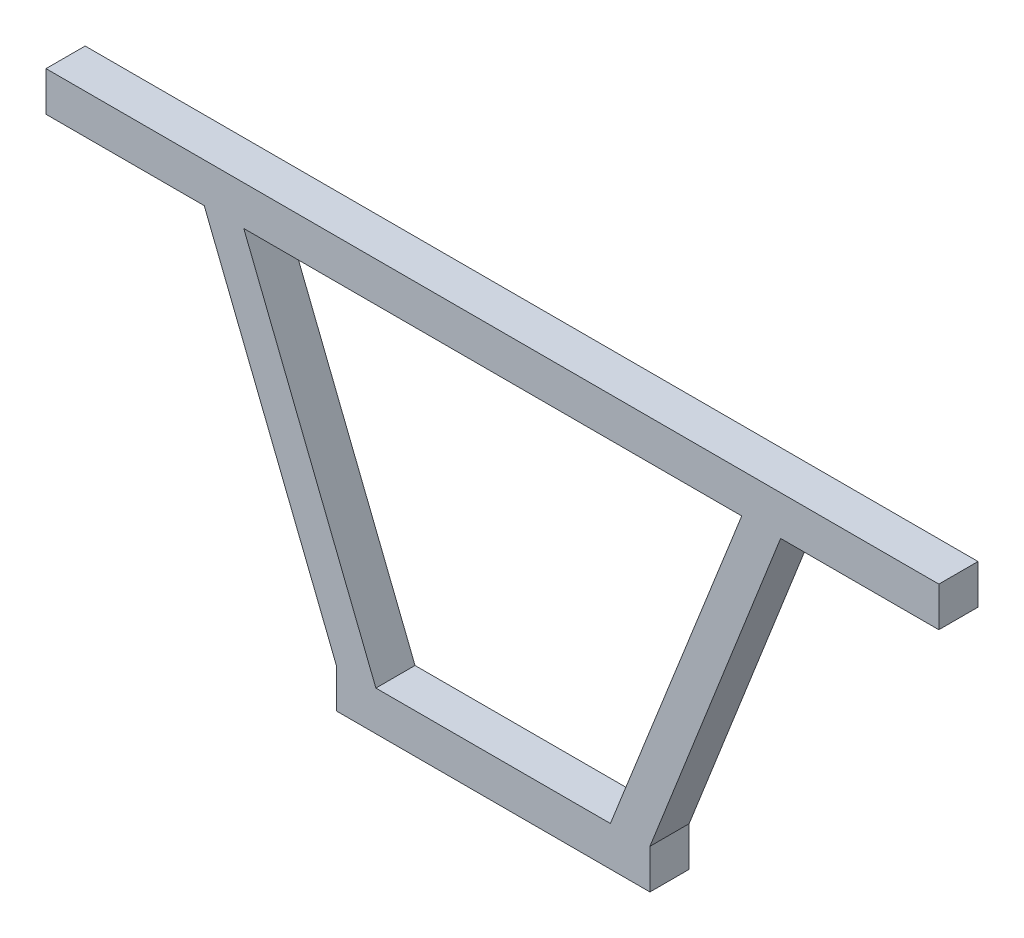
ISO-10303-21;
HEADER;
FILE_DESCRIPTION(('STEP AP214'),'2;1');
FILE_NAME('part.step','',(''),(''),'','','');
FILE_SCHEMA(('AUTOMOTIVE_DESIGN { 1 0 10303 214 1 1 1 1 }'));
ENDSEC;
DATA;
#1=APPLICATION_CONTEXT('core data for automotive mechanical design processes');
#2=APPLICATION_PROTOCOL_DEFINITION('international standard','automotive_design',2000,#1);
#3=PRODUCT_CONTEXT('',#1,'mechanical');
#4=PRODUCT('Part','Part','',(#3));
#5=PRODUCT_RELATED_PRODUCT_CATEGORY('part','',(#4));
#6=PRODUCT_DEFINITION_FORMATION('','',#4);
#7=PRODUCT_DEFINITION_CONTEXT('part definition',#1,'design');
#8=PRODUCT_DEFINITION('design','',#6,#7);
#9=PRODUCT_DEFINITION_SHAPE('','',#8);
#10=(LENGTH_UNIT() NAMED_UNIT(*) SI_UNIT(.MILLI.,.METRE.));
#11=(NAMED_UNIT(*) PLANE_ANGLE_UNIT() SI_UNIT($,.RADIAN.));
#12=(NAMED_UNIT(*) SI_UNIT($,.STERADIAN.) SOLID_ANGLE_UNIT());
#13=UNCERTAINTY_MEASURE_WITH_UNIT(LENGTH_MEASURE(1.E-05),#10,'distance_accuracy_value','');
#14=(GEOMETRIC_REPRESENTATION_CONTEXT(3) GLOBAL_UNCERTAINTY_ASSIGNED_CONTEXT((#13)) GLOBAL_UNIT_ASSIGNED_CONTEXT((#10,
#11,#12)) REPRESENTATION_CONTEXT('',''));
#15=CARTESIAN_POINT('',(0.,0.,0.));
#16=DIRECTION('',(0.,0.,1.));
#17=DIRECTION('',(1.,0.,0.));
#18=AXIS2_PLACEMENT_3D('',#15,#16,#17);
#19=CARTESIAN_POINT('',(1.17087409782305,43.0288665879575,10.));
#20=DIRECTION('',(0.,1.,0.));
#21=DIRECTION('',(0.,0.,1.));
#22=AXIS2_PLACEMENT_3D('',#19,#20,#21);
#23=PLANE('',#22);
#24=DIRECTION('',(1.,0.,0.));
#25=VECTOR('',#24,1.);
#26=CARTESIAN_POINT('',(1.17087409782305,43.0288665879575,0.));
#27=LINE('',#26,#25);
#28=CARTESIAN_POINT('',(-63.5059163059163,43.0288665879575,0.));
#29=VERTEX_POINT('',#28);
#30=CARTESIAN_POINT('',(63.6863308408762,43.0288665879575,0.));
#31=VERTEX_POINT('',#30);
#32=EDGE_CURVE('E200',#29,#31,#27,.T.);
#33=ORIENTED_EDGE('',*,*,#32,.T.);
#34=DIRECTION('',(0.,0.,-1.));
#35=VECTOR('',#34,1.);
#36=CARTESIAN_POINT('',(63.6863308408762,43.0288665879575,10.));
#37=LINE('',#36,#35);
#38=CARTESIAN_POINT('',(63.6863308408762,43.0288665879575,10.));
#39=VERTEX_POINT('',#38);
#40=EDGE_CURVE('E56',#39,#31,#37,.T.);
#41=ORIENTED_EDGE('',*,*,#40,.F.);
#42=DIRECTION('',(1.,0.,0.));
#43=VECTOR('',#42,1.);
#44=CARTESIAN_POINT('',(1.17087409782305,43.0288665879575,10.));
#45=LINE('',#44,#43);
#46=CARTESIAN_POINT('',(-63.5059163059163,43.0288665879575,10.));
#47=VERTEX_POINT('',#46);
#48=EDGE_CURVE('E229',#47,#39,#45,.T.);
#49=ORIENTED_EDGE('',*,*,#48,.F.);
#50=DIRECTION('',(0.,0.,-1.));
#51=VECTOR('',#50,1.);
#52=CARTESIAN_POINT('',(-63.5059163059163,43.0288665879575,10.));
#53=LINE('',#52,#51);
#54=EDGE_CURVE('E243',#47,#29,#53,.T.);
#55=ORIENTED_EDGE('',*,*,#54,.T.);
#56=EDGE_LOOP('',(#33,#41,#49,#55));
#57=FACE_BOUND('',#56,.T.);
#58=ADVANCED_FACE('F31',(#57),#23,.F.);
#59=DIRECTION('',(0.,0.,-1.));
#60=VECTOR('',#59,1.);
#61=CARTESIAN_POINT('',(-73.6091302636757,43.0288665879575,10.));
#62=LINE('',#61,#60);
#63=CARTESIAN_POINT('',(-73.6091302636757,43.0288665879575,10.));
#64=VERTEX_POINT('',#63);
#65=CARTESIAN_POINT('',(-73.6091302636757,43.0288665879575,0.));
#66=VERTEX_POINT('',#65);
#67=EDGE_CURVE('E405',#64,#66,#62,.T.);
#68=ORIENTED_EDGE('',*,*,#67,.F.);
#69=CARTESIAN_POINT('',(-114.021986094713,43.0288665879575,10.));
#70=VERTEX_POINT('',#69);
#71=EDGE_CURVE('E224',#70,#64,#45,.T.);
#72=ORIENTED_EDGE('',*,*,#71,.F.);
#73=DIRECTION('',(0.,0.,-1.));
#74=VECTOR('',#73,1.);
#75=CARTESIAN_POINT('',(-114.021986094713,43.0288665879575,10.));
#76=LINE('',#75,#74);
#77=CARTESIAN_POINT('',(-114.021986094713,43.0288665879575,0.));
#78=VERTEX_POINT('',#77);
#79=EDGE_CURVE('E217',#70,#78,#76,.T.);
#80=ORIENTED_EDGE('',*,*,#79,.T.);
#81=EDGE_CURVE('E213',#78,#66,#27,.T.);
#82=ORIENTED_EDGE('',*,*,#81,.T.);
#83=EDGE_LOOP('',(#68,#72,#80,#82));
#84=FACE_BOUND('',#83,.T.);
#85=ADVANCED_FACE('F258',(#84),#23,.F.);
#86=CARTESIAN_POINT('',(114.021986094713,-164.978418177507,10.));
#87=DIRECTION('',(1.,0.,0.));
#88=DIRECTION('',(0.,0.,-1.));
#89=AXIS2_PLACEMENT_3D('',#86,#87,#88);
#90=PLANE('',#89);
#91=DIRECTION('',(0.,-1.,0.));
#92=VECTOR('',#91,1.);
#93=CARTESIAN_POINT('',(114.021986094713,-164.978418177507,0.));
#94=LINE('',#93,#92);
#95=CARTESIAN_POINT('',(114.021986094713,53.1320805457169,0.));
#96=VERTEX_POINT('',#95);
#97=CARTESIAN_POINT('',(114.021986094713,43.0288665879575,0.));
#98=VERTEX_POINT('',#97);
#99=EDGE_CURVE('E239',#96,#98,#94,.T.);
#100=ORIENTED_EDGE('',*,*,#99,.F.);
#101=DIRECTION('',(0.,0.,-1.));
#102=VECTOR('',#101,1.);
#103=CARTESIAN_POINT('',(114.021986094713,53.1320805457169,10.));
#104=LINE('',#103,#102);
#105=CARTESIAN_POINT('',(114.021986094713,53.1320805457169,10.));
#106=VERTEX_POINT('',#105);
#107=EDGE_CURVE('E11',#106,#96,#104,.T.);
#108=ORIENTED_EDGE('',*,*,#107,.F.);
#109=DIRECTION('',(0.,-1.,0.));
#110=VECTOR('',#109,1.);
#111=CARTESIAN_POINT('',(114.021986094713,-164.978418177507,10.));
#112=LINE('',#111,#110);
#113=CARTESIAN_POINT('',(114.021986094713,43.0288665879575,10.));
#114=VERTEX_POINT('',#113);
#115=EDGE_CURVE('E215',#106,#114,#112,.T.);
#116=ORIENTED_EDGE('',*,*,#115,.T.);
#117=DIRECTION('',(0.,0.,-1.));
#118=VECTOR('',#117,1.);
#119=CARTESIAN_POINT('',(114.021986094713,43.0288665879575,10.));
#120=LINE('',#119,#118);
#121=EDGE_CURVE('E206',#114,#98,#120,.T.);
#122=ORIENTED_EDGE('',*,*,#121,.T.);
#123=EDGE_LOOP('',(#100,#108,#116,#122));
#124=FACE_BOUND('',#123,.T.);
#125=ADVANCED_FACE('F33',(#124),#90,.T.);
#126=CARTESIAN_POINT('',(1.17087409782305,53.1320805457169,10.));
#127=DIRECTION('',(0.,1.,0.));
#128=DIRECTION('',(0.,0.,1.));
#129=AXIS2_PLACEMENT_3D('',#126,#127,#128);
#130=PLANE('',#129);
#131=DIRECTION('',(1.,0.,0.));
#132=VECTOR('',#131,1.);
#133=CARTESIAN_POINT('',(1.17087409782305,53.1320805457169,0.));
#134=LINE('',#133,#132);
#135=CARTESIAN_POINT('',(-114.021986094713,53.1320805457169,0.));
#136=VERTEX_POINT('',#135);
#137=EDGE_CURVE('E242',#136,#96,#134,.T.);
#138=ORIENTED_EDGE('',*,*,#137,.F.);
#139=DIRECTION('',(0.,0.,-1.));
#140=VECTOR('',#139,1.);
#141=CARTESIAN_POINT('',(-114.021986094713,53.1320805457169,10.));
#142=LINE('',#141,#140);
#143=CARTESIAN_POINT('',(-114.021986094713,53.1320805457169,10.));
#144=VERTEX_POINT('',#143);
#145=EDGE_CURVE('E41',#144,#136,#142,.T.);
#146=ORIENTED_EDGE('',*,*,#145,.F.);
#147=DIRECTION('',(1.,0.,0.));
#148=VECTOR('',#147,1.);
#149=CARTESIAN_POINT('',(1.17087409782305,53.1320805457169,10.));
#150=LINE('',#149,#148);
#151=EDGE_CURVE('E255',#144,#106,#150,.T.);
#152=ORIENTED_EDGE('',*,*,#151,.T.);
#153=ORIENTED_EDGE('',*,*,#107,.T.);
#154=EDGE_LOOP('',(#138,#146,#152,#153));
#155=FACE_BOUND('',#154,.T.);
#156=ADVANCED_FACE('F252',(#155),#130,.T.);
#157=CARTESIAN_POINT('',(-114.021986094713,-164.978418177507,10.));
#158=DIRECTION('',(1.,0.,0.));
#159=DIRECTION('',(0.,0.,-1.));
#160=AXIS2_PLACEMENT_3D('',#157,#158,#159);
#161=PLANE('',#160);
#162=DIRECTION('',(0.,-1.,0.));
#163=VECTOR('',#162,1.);
#164=CARTESIAN_POINT('',(-114.021986094713,-164.978418177507,0.));
#165=LINE('',#164,#163);
#166=EDGE_CURVE('E201',#136,#78,#165,.T.);
#167=ORIENTED_EDGE('',*,*,#166,.T.);
#168=ORIENTED_EDGE('',*,*,#79,.F.);
#169=DIRECTION('',(0.,-1.,0.));
#170=VECTOR('',#169,1.);
#171=CARTESIAN_POINT('',(-114.021986094713,-164.978418177507,10.));
#172=LINE('',#171,#170);
#173=EDGE_CURVE('E237',#144,#70,#172,.T.);
#174=ORIENTED_EDGE('',*,*,#173,.F.);
#175=ORIENTED_EDGE('',*,*,#145,.T.);
#176=EDGE_LOOP('',(#167,#168,#174,#175));
#177=FACE_BOUND('',#176,.T.);
#178=ADVANCED_FACE('F248',(#177),#161,.F.);
#179=CARTESIAN_POINT('',(73.6091302636757,43.0288665879575,10.));
#180=VERTEX_POINT('',#179);
#181=EDGE_CURVE('E35',#180,#114,#45,.T.);
#182=ORIENTED_EDGE('',*,*,#181,.F.);
#183=DIRECTION('',(0.,0.,-1.));
#184=VECTOR('',#183,1.);
#185=CARTESIAN_POINT('',(73.6091302636757,43.0288665879575,10.));
#186=LINE('',#185,#184);
#187=CARTESIAN_POINT('',(73.6091302636757,43.0288665879575,0.));
#188=VERTEX_POINT('',#187);
#189=EDGE_CURVE('E173',#180,#188,#186,.T.);
#190=ORIENTED_EDGE('',*,*,#189,.T.);
#191=EDGE_CURVE('E162',#188,#98,#27,.T.);
#192=ORIENTED_EDGE('',*,*,#191,.T.);
#193=ORIENTED_EDGE('',*,*,#121,.F.);
#194=EDGE_LOOP('',(#182,#190,#192,#193));
#195=FACE_BOUND('',#194,.T.);
#196=ADVANCED_FACE('F264',(#195),#23,.F.);
#197=CARTESIAN_POINT('',(1.17087409782305,-164.978418177507,10.));
#198=DIRECTION('',(0.,0.,1.));
#199=DIRECTION('',(1.,0.,0.));
#200=AXIS2_PLACEMENT_3D('',#197,#198,#199);
#201=PLANE('',#200);
#202=DIRECTION('',(-0.366264831108058,-0.930510652004256,0.));
#203=VECTOR('',#202,1.);
#204=CARTESIAN_POINT('',(-7.00011119691586,-161.762179284897,10.));
#205=LINE('',#204,#203);
#206=CARTESIAN_POINT('',(40.2324412960777,-41.7659648432376,10.));
#207=VERTEX_POINT('',#206);
#208=EDGE_CURVE('E155',#180,#207,#205,.T.);
#209=ORIENTED_EDGE('',*,*,#208,.F.);
#210=ORIENTED_EDGE('',*,*,#181,.T.);
#211=ORIENTED_EDGE('',*,*,#115,.F.);
#212=ORIENTED_EDGE('',*,*,#151,.F.);
#213=ORIENTED_EDGE('',*,*,#173,.T.);
#214=ORIENTED_EDGE('',*,*,#71,.T.);
#215=DIRECTION('',(-0.36968580121388,0.929156826580342,0.));
#216=VECTOR('',#215,1.);
#217=CARTESIAN_POINT('',(8.06056098674495,-162.237202330212,10.));
#218=LINE('',#217,#216);
#219=CARTESIAN_POINT('',(-39.8716122261577,-41.7659648432376,10.));
#220=VERTEX_POINT('',#219);
#221=EDGE_CURVE('E196',#220,#64,#218,.T.);
#222=ORIENTED_EDGE('',*,*,#221,.F.);
#223=DIRECTION('',(0.,-1.,0.));
#224=VECTOR('',#223,1.);
#225=CARTESIAN_POINT('',(-39.8716122261577,-164.978418177507,10.));
#226=LINE('',#225,#224);
#227=CARTESIAN_POINT('',(-39.8716122261577,-51.869178800997,10.));
#228=VERTEX_POINT('',#227);
#229=EDGE_CURVE('E182',#220,#228,#226,.T.);
#230=ORIENTED_EDGE('',*,*,#229,.T.);
#231=DIRECTION('',(1.,0.,0.));
#232=VECTOR('',#231,1.);
#233=CARTESIAN_POINT('',(1.17087409782305,-51.869178800997,10.));
#234=LINE('',#233,#232);
#235=CARTESIAN_POINT('',(40.2324412960777,-51.869178800997,10.));
#236=VERTEX_POINT('',#235);
#237=EDGE_CURVE('E425',#228,#236,#234,.T.);
#238=ORIENTED_EDGE('',*,*,#237,.T.);
#239=DIRECTION('',(0.,-1.,0.));
#240=VECTOR('',#239,1.);
#241=CARTESIAN_POINT('',(40.2324412960777,-164.978418177507,10.));
#242=LINE('',#241,#240);
#243=EDGE_CURVE('E176',#207,#236,#242,.T.);
#244=ORIENTED_EDGE('',*,*,#243,.F.);
#245=EDGE_LOOP('',(#209,#210,#211,#212,#213,#214,#222,#230,#238,#244));
#246=FACE_BOUND('',#245,.T.);
#247=ORIENTED_EDGE('',*,*,#48,.T.);
#248=DIRECTION('',(0.36797718399465,0.92983481977143,0.));
#249=VECTOR('',#248,1.);
#250=CARTESIAN_POINT('',(-15.9500688510154,-158.202896074349,10.));
#251=LINE('',#250,#249);
#252=CARTESIAN_POINT('',(30.1292273383182,-41.7659648432376,10.));
#253=VERTEX_POINT('',#252);
#254=EDGE_CURVE('E163',#253,#39,#251,.T.);
#255=ORIENTED_EDGE('',*,*,#254,.F.);
#256=DIRECTION('',(1.,0.,0.));
#257=VECTOR('',#256,1.);
#258=CARTESIAN_POINT('',(1.17087409782305,-41.7659648432376,10.));
#259=LINE('',#258,#257);
#260=CARTESIAN_POINT('',(-29.7683982683984,-41.7659648432376,10.));
#261=VERTEX_POINT('',#260);
#262=EDGE_CURVE('E178',#261,#253,#259,.T.);
#263=ORIENTED_EDGE('',*,*,#262,.F.);
#264=DIRECTION('',(0.36968580121388,-0.929156826580342,0.));
#265=VECTOR('',#264,1.);
#266=CARTESIAN_POINT('',(16.7829930252843,-158.766787880836,10.));
#267=LINE('',#266,#265);
#268=EDGE_CURVE('E412',#47,#261,#267,.T.);
#269=ORIENTED_EDGE('',*,*,#268,.F.);
#270=EDGE_LOOP('',(#247,#255,#263,#269));
#271=FACE_BOUND('',#270,.T.);
#272=ADVANCED_FACE('F271',(#246,#271),#201,.T.);
#273=CARTESIAN_POINT('',(1.17087409782305,-164.978418177507,0.));
#274=DIRECTION('',(0.,0.,1.));
#275=DIRECTION('',(1.,0.,0.));
#276=AXIS2_PLACEMENT_3D('',#273,#274,#275);
#277=PLANE('',#276);
#278=ORIENTED_EDGE('',*,*,#191,.F.);
#279=DIRECTION('',(-0.366264831108058,-0.930510652004256,0.));
#280=VECTOR('',#279,1.);
#281=CARTESIAN_POINT('',(-7.00011119691586,-161.762179284897,0.));
#282=LINE('',#281,#280);
#283=CARTESIAN_POINT('',(40.2324412960777,-41.7659648432376,0.));
#284=VERTEX_POINT('',#283);
#285=EDGE_CURVE('E153',#188,#284,#282,.T.);
#286=ORIENTED_EDGE('',*,*,#285,.T.);
#287=DIRECTION('',(0.,-1.,0.));
#288=VECTOR('',#287,1.);
#289=CARTESIAN_POINT('',(40.2324412960777,-164.978418177507,0.));
#290=LINE('',#289,#288);
#291=CARTESIAN_POINT('',(40.2324412960777,-51.869178800997,0.));
#292=VERTEX_POINT('',#291);
#293=EDGE_CURVE('E134',#284,#292,#290,.T.);
#294=ORIENTED_EDGE('',*,*,#293,.T.);
#295=DIRECTION('',(1.,0.,0.));
#296=VECTOR('',#295,1.);
#297=CARTESIAN_POINT('',(1.17087409782305,-51.869178800997,0.));
#298=LINE('',#297,#296);
#299=CARTESIAN_POINT('',(-39.8716122261577,-51.869178800997,0.));
#300=VERTEX_POINT('',#299);
#301=EDGE_CURVE('E179',#300,#292,#298,.T.);
#302=ORIENTED_EDGE('',*,*,#301,.F.);
#303=DIRECTION('',(0.,-1.,0.));
#304=VECTOR('',#303,1.);
#305=CARTESIAN_POINT('',(-39.8716122261577,-164.978418177507,0.));
#306=LINE('',#305,#304);
#307=CARTESIAN_POINT('',(-39.8716122261577,-41.7659648432376,0.));
#308=VERTEX_POINT('',#307);
#309=EDGE_CURVE('E432',#308,#300,#306,.T.);
#310=ORIENTED_EDGE('',*,*,#309,.F.);
#311=DIRECTION('',(-0.36968580121388,0.929156826580342,0.));
#312=VECTOR('',#311,1.);
#313=CARTESIAN_POINT('',(8.06056098674495,-162.237202330212,0.));
#314=LINE('',#313,#312);
#315=EDGE_CURVE('E404',#308,#66,#314,.T.);
#316=ORIENTED_EDGE('',*,*,#315,.T.);
#317=ORIENTED_EDGE('',*,*,#81,.F.);
#318=ORIENTED_EDGE('',*,*,#166,.F.);
#319=ORIENTED_EDGE('',*,*,#137,.T.);
#320=ORIENTED_EDGE('',*,*,#99,.T.);
#321=EDGE_LOOP('',(#278,#286,#294,#302,#310,#316,#317,#318,#319,#320));
#322=FACE_BOUND('',#321,.T.);
#323=DIRECTION('',(0.36797718399465,0.92983481977143,0.));
#324=VECTOR('',#323,1.);
#325=CARTESIAN_POINT('',(-15.9500688510154,-158.202896074349,0.));
#326=LINE('',#325,#324);
#327=CARTESIAN_POINT('',(30.1292273383182,-41.7659648432376,0.));
#328=VERTEX_POINT('',#327);
#329=EDGE_CURVE('E164',#328,#31,#326,.T.);
#330=ORIENTED_EDGE('',*,*,#329,.T.);
#331=ORIENTED_EDGE('',*,*,#32,.F.);
#332=DIRECTION('',(0.36968580121388,-0.929156826580342,0.));
#333=VECTOR('',#332,1.);
#334=CARTESIAN_POINT('',(16.7829930252843,-158.766787880836,0.));
#335=LINE('',#334,#333);
#336=CARTESIAN_POINT('',(-29.7683982683984,-41.7659648432376,0.));
#337=VERTEX_POINT('',#336);
#338=EDGE_CURVE('E156',#29,#337,#335,.T.);
#339=ORIENTED_EDGE('',*,*,#338,.T.);
#340=DIRECTION('',(1.,0.,0.));
#341=VECTOR('',#340,1.);
#342=CARTESIAN_POINT('',(1.17087409782305,-41.7659648432376,0.));
#343=LINE('',#342,#341);
#344=EDGE_CURVE('E146',#337,#328,#343,.T.);
#345=ORIENTED_EDGE('',*,*,#344,.T.);
#346=EDGE_LOOP('',(#330,#331,#339,#345));
#347=FACE_BOUND('',#346,.T.);
#348=ADVANCED_FACE('F159',(#322,#347),#277,.F.);
#349=CARTESIAN_POINT('',(16.7829930252843,-158.766787880836,10.));
#350=DIRECTION('',(0.929156826580342,0.36968580121388,0.));
#351=DIRECTION('',(-0.36968580121388,0.929156826580342,0.));
#352=AXIS2_PLACEMENT_3D('',#349,#350,#351);
#353=PLANE('',#352);
#354=ORIENTED_EDGE('',*,*,#338,.F.);
#355=ORIENTED_EDGE('',*,*,#54,.F.);
#356=ORIENTED_EDGE('',*,*,#268,.T.);
#357=DIRECTION('',(0.,0.,-1.));
#358=VECTOR('',#357,1.);
#359=CARTESIAN_POINT('',(-29.7683982683984,-41.7659648432376,10.));
#360=LINE('',#359,#358);
#361=EDGE_CURVE('E193',#261,#337,#360,.T.);
#362=ORIENTED_EDGE('',*,*,#361,.T.);
#363=EDGE_LOOP('',(#354,#355,#356,#362));
#364=FACE_BOUND('',#363,.T.);
#365=ADVANCED_FACE('F316',(#364),#353,.T.);
#366=CARTESIAN_POINT('',(8.06056098674495,-162.237202330212,10.));
#367=DIRECTION('',(-0.929156826580342,-0.36968580121388,0.));
#368=DIRECTION('',(0.36968580121388,-0.929156826580342,0.));
#369=AXIS2_PLACEMENT_3D('',#366,#367,#368);
#370=PLANE('',#369);
#371=ORIENTED_EDGE('',*,*,#315,.F.);
#372=DIRECTION('',(0.,0.,-1.));
#373=VECTOR('',#372,1.);
#374=CARTESIAN_POINT('',(-39.8716122261577,-41.7659648432376,10.));
#375=LINE('',#374,#373);
#376=EDGE_CURVE('E190',#220,#308,#375,.T.);
#377=ORIENTED_EDGE('',*,*,#376,.F.);
#378=ORIENTED_EDGE('',*,*,#221,.T.);
#379=ORIENTED_EDGE('',*,*,#67,.T.);
#380=EDGE_LOOP('',(#371,#377,#378,#379));
#381=FACE_BOUND('',#380,.T.);
#382=ADVANCED_FACE('F334',(#381),#370,.T.);
#383=CARTESIAN_POINT('',(1.17087409782305,-41.7659648432376,10.));
#384=DIRECTION('',(0.,1.,0.));
#385=DIRECTION('',(0.,0.,1.));
#386=AXIS2_PLACEMENT_3D('',#383,#384,#385);
#387=PLANE('',#386);
#388=DIRECTION('',(0.,0.,-1.));
#389=VECTOR('',#388,1.);
#390=CARTESIAN_POINT('',(30.1292273383182,-41.7659648432376,10.));
#391=LINE('',#390,#389);
#392=EDGE_CURVE('E147',#253,#328,#391,.T.);
#393=ORIENTED_EDGE('',*,*,#392,.T.);
#394=ORIENTED_EDGE('',*,*,#344,.F.);
#395=ORIENTED_EDGE('',*,*,#361,.F.);
#396=ORIENTED_EDGE('',*,*,#262,.T.);
#397=EDGE_LOOP('',(#393,#394,#395,#396));
#398=FACE_BOUND('',#397,.T.);
#399=ADVANCED_FACE('F328',(#398),#387,.T.);
#400=CARTESIAN_POINT('',(40.2324412960777,-164.978418177507,10.));
#401=DIRECTION('',(1.,0.,0.));
#402=DIRECTION('',(0.,0.,-1.));
#403=AXIS2_PLACEMENT_3D('',#400,#401,#402);
#404=PLANE('',#403);
#405=ORIENTED_EDGE('',*,*,#293,.F.);
#406=DIRECTION('',(0.,0.,-1.));
#407=VECTOR('',#406,1.);
#408=CARTESIAN_POINT('',(40.2324412960777,-41.7659648432376,10.));
#409=LINE('',#408,#407);
#410=EDGE_CURVE('E138',#207,#284,#409,.T.);
#411=ORIENTED_EDGE('',*,*,#410,.F.);
#412=ORIENTED_EDGE('',*,*,#243,.T.);
#413=DIRECTION('',(0.,0.,-1.));
#414=VECTOR('',#413,1.);
#415=CARTESIAN_POINT('',(40.2324412960777,-51.869178800997,10.));
#416=LINE('',#415,#414);
#417=EDGE_CURVE('E141',#236,#292,#416,.T.);
#418=ORIENTED_EDGE('',*,*,#417,.T.);
#419=EDGE_LOOP('',(#405,#411,#412,#418));
#420=FACE_BOUND('',#419,.T.);
#421=ADVANCED_FACE('F136',(#420),#404,.T.);
#422=CARTESIAN_POINT('',(-39.8716122261577,-164.978418177507,10.));
#423=DIRECTION('',(1.,0.,0.));
#424=DIRECTION('',(0.,0.,-1.));
#425=AXIS2_PLACEMENT_3D('',#422,#423,#424);
#426=PLANE('',#425);
#427=ORIENTED_EDGE('',*,*,#309,.T.);
#428=DIRECTION('',(0.,0.,-1.));
#429=VECTOR('',#428,1.);
#430=CARTESIAN_POINT('',(-39.8716122261577,-51.869178800997,10.));
#431=LINE('',#430,#429);
#432=EDGE_CURVE('E157',#228,#300,#431,.T.);
#433=ORIENTED_EDGE('',*,*,#432,.F.);
#434=ORIENTED_EDGE('',*,*,#229,.F.);
#435=ORIENTED_EDGE('',*,*,#376,.T.);
#436=EDGE_LOOP('',(#427,#433,#434,#435));
#437=FACE_BOUND('',#436,.T.);
#438=ADVANCED_FACE('F352',(#437),#426,.F.);
#439=CARTESIAN_POINT('',(1.17087409782305,-51.869178800997,10.));
#440=DIRECTION('',(0.,1.,0.));
#441=DIRECTION('',(0.,0.,1.));
#442=AXIS2_PLACEMENT_3D('',#439,#440,#441);
#443=PLANE('',#442);
#444=ORIENTED_EDGE('',*,*,#301,.T.);
#445=ORIENTED_EDGE('',*,*,#417,.F.);
#446=ORIENTED_EDGE('',*,*,#237,.F.);
#447=ORIENTED_EDGE('',*,*,#432,.T.);
#448=EDGE_LOOP('',(#444,#445,#446,#447));
#449=FACE_BOUND('',#448,.T.);
#450=ADVANCED_FACE('F361',(#449),#443,.F.);
#451=CARTESIAN_POINT('',(-15.9500688510154,-158.202896074349,10.));
#452=DIRECTION('',(-0.92983481977143,0.36797718399465,0.));
#453=DIRECTION('',(-0.36797718399465,-0.92983481977143,0.));
#454=AXIS2_PLACEMENT_3D('',#451,#452,#453);
#455=PLANE('',#454);
#456=ORIENTED_EDGE('',*,*,#329,.F.);
#457=ORIENTED_EDGE('',*,*,#392,.F.);
#458=ORIENTED_EDGE('',*,*,#254,.T.);
#459=ORIENTED_EDGE('',*,*,#40,.T.);
#460=EDGE_LOOP('',(#456,#457,#458,#459));
#461=FACE_BOUND('',#460,.T.);
#462=ADVANCED_FACE('F370',(#461),#455,.T.);
#463=CARTESIAN_POINT('',(-7.00011119691586,-161.762179284897,10.));
#464=DIRECTION('',(0.930510652004256,-0.366264831108058,0.));
#465=DIRECTION('',(0.366264831108058,0.930510652004256,0.));
#466=AXIS2_PLACEMENT_3D('',#463,#464,#465);
#467=PLANE('',#466);
#468=ORIENTED_EDGE('',*,*,#285,.F.);
#469=ORIENTED_EDGE('',*,*,#189,.F.);
#470=ORIENTED_EDGE('',*,*,#208,.T.);
#471=ORIENTED_EDGE('',*,*,#410,.T.);
#472=EDGE_LOOP('',(#468,#469,#470,#471));
#473=FACE_BOUND('',#472,.T.);
#474=ADVANCED_FACE('F152',(#473),#467,.T.);
#475=CLOSED_SHELL('',(#58,#85,#125,#156,#178,#196,#272,#348,#365,#382,#399,#421,#438,#450,#462,#474));
#476=MANIFOLD_SOLID_BREP('B2',#475);
#477=ADVANCED_BREP_SHAPE_REPRESENTATION('',(#18,#476),#14);
#478=SHAPE_DEFINITION_REPRESENTATION(#9,#477);
ENDSEC;
END-ISO-10303-21;
